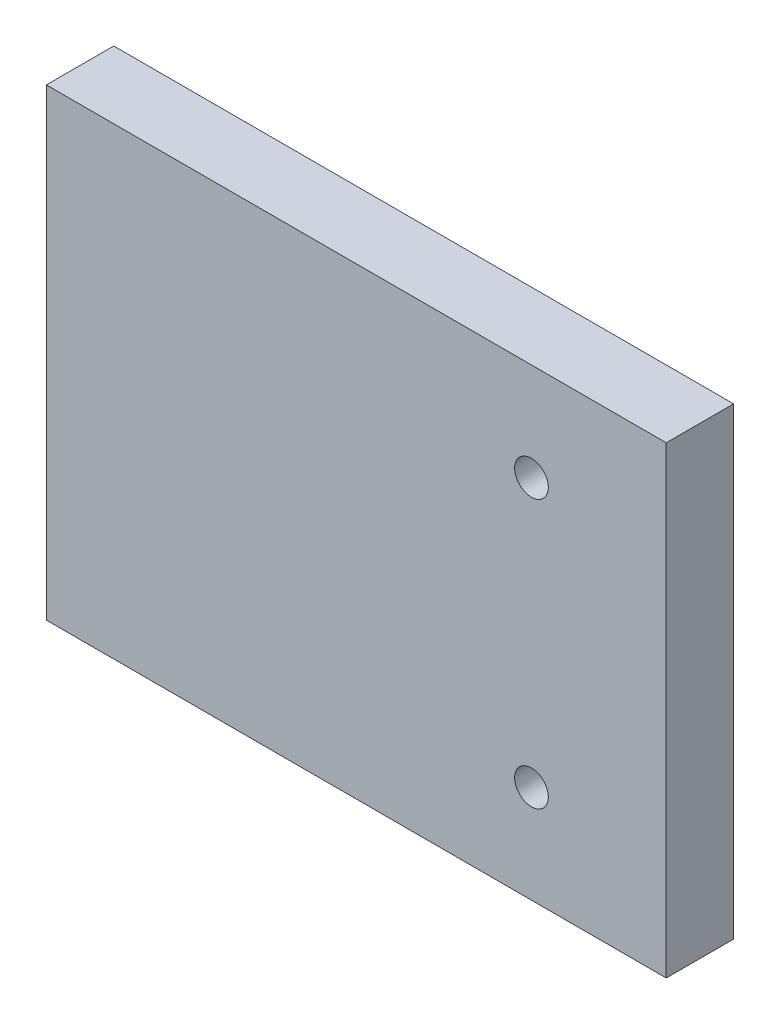
ISO-10303-21;
HEADER;
FILE_DESCRIPTION(('STEP AP214'),'2;1');
FILE_NAME('part.step','',(''),(''),'','','');
FILE_SCHEMA(('AUTOMOTIVE_DESIGN { 1 0 10303 214 1 1 1 1 }'));
ENDSEC;
DATA;
#1=APPLICATION_CONTEXT('core data for automotive mechanical design processes');
#2=APPLICATION_PROTOCOL_DEFINITION('international standard','automotive_design',2000,#1);
#3=PRODUCT_CONTEXT('',#1,'mechanical');
#4=PRODUCT('Part','Part','',(#3));
#5=PRODUCT_RELATED_PRODUCT_CATEGORY('part','',(#4));
#6=PRODUCT_DEFINITION_FORMATION('','',#4);
#7=PRODUCT_DEFINITION_CONTEXT('part definition',#1,'design');
#8=PRODUCT_DEFINITION('design','',#6,#7);
#9=PRODUCT_DEFINITION_SHAPE('','',#8);
#10=(LENGTH_UNIT() NAMED_UNIT(*) SI_UNIT(.MILLI.,.METRE.));
#11=(NAMED_UNIT(*) PLANE_ANGLE_UNIT() SI_UNIT($,.RADIAN.));
#12=(NAMED_UNIT(*) SI_UNIT($,.STERADIAN.) SOLID_ANGLE_UNIT());
#13=UNCERTAINTY_MEASURE_WITH_UNIT(LENGTH_MEASURE(1.E-05),#10,'distance_accuracy_value','');
#14=(GEOMETRIC_REPRESENTATION_CONTEXT(3) GLOBAL_UNCERTAINTY_ASSIGNED_CONTEXT((#13)) GLOBAL_UNIT_ASSIGNED_CONTEXT((#10,
#11,#12)) REPRESENTATION_CONTEXT('',''));
#15=CARTESIAN_POINT('',(0.,0.,0.));
#16=DIRECTION('',(0.,0.,1.));
#17=DIRECTION('',(1.,0.,0.));
#18=AXIS2_PLACEMENT_3D('',#15,#16,#17);
#19=CARTESIAN_POINT('',(0.,0.,6.35));
#20=DIRECTION('',(0.,0.,-1.));
#21=DIRECTION('',(-1.,0.,0.));
#22=AXIS2_PLACEMENT_3D('',#19,#20,#21);
#23=PLANE('',#22);
#24=CARTESIAN_POINT('',(45.72,34.4805,6.35));
#25=DIRECTION('',(0.,0.,1.));
#26=DIRECTION('',(1.,0.,0.));
#27=AXIS2_PLACEMENT_3D('',#24,#25,#26);
#28=CIRCLE('',#27,1.5875);
#29=CARTESIAN_POINT('',(47.3075,34.4805,6.35));
#30=VERTEX_POINT('',#29);
#31=EDGE_CURVE('E102',#30,#30,#28,.T.);
#32=ORIENTED_EDGE('',*,*,#31,.F.);
#33=EDGE_LOOP('',(#32));
#34=FACE_BOUND('',#33,.T.);
#35=DIRECTION('',(0.,-1.,0.));
#36=VECTOR('',#35,1.);
#37=CARTESIAN_POINT('',(0.,0.,6.35));
#38=LINE('',#37,#36);
#39=CARTESIAN_POINT('',(0.,43.688,6.35));
#40=VERTEX_POINT('',#39);
#41=CARTESIAN_POINT('',(0.,0.,6.35));
#42=VERTEX_POINT('',#41);
#43=EDGE_CURVE('E87',#40,#42,#38,.T.);
#44=ORIENTED_EDGE('',*,*,#43,.T.);
#45=DIRECTION('',(1.,0.,0.));
#46=VECTOR('',#45,1.);
#47=CARTESIAN_POINT('',(0.,0.,6.35));
#48=LINE('',#47,#46);
#49=CARTESIAN_POINT('',(58.42,0.,6.35));
#50=VERTEX_POINT('',#49);
#51=EDGE_CURVE('E82',#42,#50,#48,.T.);
#52=ORIENTED_EDGE('',*,*,#51,.T.);
#53=DIRECTION('',(0.,1.,0.));
#54=VECTOR('',#53,1.);
#55=CARTESIAN_POINT('',(58.42,0.,6.35));
#56=LINE('',#55,#54);
#57=CARTESIAN_POINT('',(58.42,43.688,6.35));
#58=VERTEX_POINT('',#57);
#59=EDGE_CURVE('E85',#50,#58,#56,.T.);
#60=ORIENTED_EDGE('',*,*,#59,.T.);
#61=DIRECTION('',(-1.,0.,0.));
#62=VECTOR('',#61,1.);
#63=CARTESIAN_POINT('',(0.,43.688,6.35));
#64=LINE('',#63,#62);
#65=EDGE_CURVE('E52',#58,#40,#64,.T.);
#66=ORIENTED_EDGE('',*,*,#65,.T.);
#67=EDGE_LOOP('',(#44,#52,#60,#66));
#68=FACE_BOUND('',#67,.T.);
#69=CARTESIAN_POINT('',(45.72,9.20749999999999,6.35));
#70=DIRECTION('',(0.,0.,1.));
#71=DIRECTION('',(-1.,0.,0.));
#72=AXIS2_PLACEMENT_3D('',#69,#70,#71);
#73=CIRCLE('',#72,1.5875);
#74=CARTESIAN_POINT('',(44.1325,9.20749999999999,6.35));
#75=VERTEX_POINT('',#74);
#76=EDGE_CURVE('E117',#75,#75,#73,.T.);
#77=ORIENTED_EDGE('',*,*,#76,.F.);
#78=EDGE_LOOP('',(#77));
#79=FACE_BOUND('',#78,.T.);
#80=ADVANCED_FACE('F35',(#34,#68,#79),#23,.F.);
#81=CARTESIAN_POINT('',(0.,0.,0.));
#82=DIRECTION('',(0.,0.,-1.));
#83=DIRECTION('',(-1.,0.,0.));
#84=AXIS2_PLACEMENT_3D('',#81,#82,#83);
#85=PLANE('',#84);
#86=CARTESIAN_POINT('',(45.72,34.4805,0.));
#87=DIRECTION('',(0.,0.,1.));
#88=DIRECTION('',(1.,0.,0.));
#89=AXIS2_PLACEMENT_3D('',#86,#87,#88);
#90=CIRCLE('',#89,1.5875);
#91=CARTESIAN_POINT('',(47.3075,34.4805,0.));
#92=VERTEX_POINT('',#91);
#93=EDGE_CURVE('E114',#92,#92,#90,.T.);
#94=ORIENTED_EDGE('',*,*,#93,.T.);
#95=EDGE_LOOP('',(#94));
#96=FACE_BOUND('',#95,.T.);
#97=DIRECTION('',(0.,-1.,0.));
#98=VECTOR('',#97,1.);
#99=CARTESIAN_POINT('',(0.,0.,0.));
#100=LINE('',#99,#98);
#101=CARTESIAN_POINT('',(0.,43.688,0.));
#102=VERTEX_POINT('',#101);
#103=CARTESIAN_POINT('',(0.,0.,0.));
#104=VERTEX_POINT('',#103);
#105=EDGE_CURVE('E99',#102,#104,#100,.T.);
#106=ORIENTED_EDGE('',*,*,#105,.F.);
#107=DIRECTION('',(-1.,0.,0.));
#108=VECTOR('',#107,1.);
#109=CARTESIAN_POINT('',(0.,43.688,0.));
#110=LINE('',#109,#108);
#111=CARTESIAN_POINT('',(58.42,43.688,0.));
#112=VERTEX_POINT('',#111);
#113=EDGE_CURVE('E75',#112,#102,#110,.T.);
#114=ORIENTED_EDGE('',*,*,#113,.F.);
#115=DIRECTION('',(0.,1.,0.));
#116=VECTOR('',#115,1.);
#117=CARTESIAN_POINT('',(58.42,0.,0.));
#118=LINE('',#117,#116);
#119=CARTESIAN_POINT('',(58.42,0.,0.));
#120=VERTEX_POINT('',#119);
#121=EDGE_CURVE('E69',#120,#112,#118,.T.);
#122=ORIENTED_EDGE('',*,*,#121,.F.);
#123=DIRECTION('',(1.,0.,0.));
#124=VECTOR('',#123,1.);
#125=CARTESIAN_POINT('',(0.,0.,0.));
#126=LINE('',#125,#124);
#127=EDGE_CURVE('E91',#104,#120,#126,.T.);
#128=ORIENTED_EDGE('',*,*,#127,.F.);
#129=EDGE_LOOP('',(#106,#114,#122,#128));
#130=FACE_BOUND('',#129,.T.);
#131=CARTESIAN_POINT('',(45.72,9.20749999999999,0.));
#132=DIRECTION('',(0.,0.,1.));
#133=DIRECTION('',(-1.,0.,0.));
#134=AXIS2_PLACEMENT_3D('',#131,#132,#133);
#135=CIRCLE('',#134,1.5875);
#136=CARTESIAN_POINT('',(44.1325,9.20749999999999,0.));
#137=VERTEX_POINT('',#136);
#138=EDGE_CURVE('E120',#137,#137,#135,.T.);
#139=ORIENTED_EDGE('',*,*,#138,.T.);
#140=EDGE_LOOP('',(#139));
#141=FACE_BOUND('',#140,.T.);
#142=ADVANCED_FACE('F110',(#96,#130,#141),#85,.T.);
#143=CARTESIAN_POINT('',(0.,0.,6.35));
#144=DIRECTION('',(1.,0.,0.));
#145=DIRECTION('',(0.,0.,-1.));
#146=AXIS2_PLACEMENT_3D('',#143,#144,#145);
#147=PLANE('',#146);
#148=ORIENTED_EDGE('',*,*,#105,.T.);
#149=DIRECTION('',(0.,0.,-1.));
#150=VECTOR('',#149,1.);
#151=CARTESIAN_POINT('',(0.,0.,6.35));
#152=LINE('',#151,#150);
#153=EDGE_CURVE('E11',#42,#104,#152,.T.);
#154=ORIENTED_EDGE('',*,*,#153,.F.);
#155=ORIENTED_EDGE('',*,*,#43,.F.);
#156=DIRECTION('',(0.,0.,-1.));
#157=VECTOR('',#156,1.);
#158=CARTESIAN_POINT('',(0.,43.688,6.35));
#159=LINE('',#158,#157);
#160=EDGE_CURVE('E95',#40,#102,#159,.T.);
#161=ORIENTED_EDGE('',*,*,#160,.T.);
#162=EDGE_LOOP('',(#148,#154,#155,#161));
#163=FACE_BOUND('',#162,.T.);
#164=ADVANCED_FACE('F37',(#163),#147,.F.);
#165=CARTESIAN_POINT('',(0.,0.,6.35));
#166=DIRECTION('',(0.,1.,0.));
#167=DIRECTION('',(0.,0.,1.));
#168=AXIS2_PLACEMENT_3D('',#165,#166,#167);
#169=PLANE('',#168);
#170=ORIENTED_EDGE('',*,*,#127,.T.);
#171=DIRECTION('',(0.,0.,-1.));
#172=VECTOR('',#171,1.);
#173=CARTESIAN_POINT('',(58.42,0.,6.35));
#174=LINE('',#173,#172);
#175=EDGE_CURVE('E44',#50,#120,#174,.T.);
#176=ORIENTED_EDGE('',*,*,#175,.F.);
#177=ORIENTED_EDGE('',*,*,#51,.F.);
#178=ORIENTED_EDGE('',*,*,#153,.T.);
#179=EDGE_LOOP('',(#170,#176,#177,#178));
#180=FACE_BOUND('',#179,.T.);
#181=ADVANCED_FACE('F90',(#180),#169,.F.);
#182=CARTESIAN_POINT('',(58.42,0.,6.35));
#183=DIRECTION('',(-1.,0.,0.));
#184=DIRECTION('',(0.,0.,1.));
#185=AXIS2_PLACEMENT_3D('',#182,#183,#184);
#186=PLANE('',#185);
#187=ORIENTED_EDGE('',*,*,#121,.T.);
#188=DIRECTION('',(0.,0.,-1.));
#189=VECTOR('',#188,1.);
#190=CARTESIAN_POINT('',(58.42,43.688,6.35));
#191=LINE('',#190,#189);
#192=EDGE_CURVE('E92',#58,#112,#191,.T.);
#193=ORIENTED_EDGE('',*,*,#192,.F.);
#194=ORIENTED_EDGE('',*,*,#59,.F.);
#195=ORIENTED_EDGE('',*,*,#175,.T.);
#196=EDGE_LOOP('',(#187,#193,#194,#195));
#197=FACE_BOUND('',#196,.T.);
#198=ADVANCED_FACE('F93',(#197),#186,.F.);
#199=CARTESIAN_POINT('',(0.,43.688,6.35));
#200=DIRECTION('',(0.,-1.,0.));
#201=DIRECTION('',(0.,0.,-1.));
#202=AXIS2_PLACEMENT_3D('',#199,#200,#201);
#203=PLANE('',#202);
#204=ORIENTED_EDGE('',*,*,#113,.T.);
#205=ORIENTED_EDGE('',*,*,#160,.F.);
#206=ORIENTED_EDGE('',*,*,#65,.F.);
#207=ORIENTED_EDGE('',*,*,#192,.T.);
#208=EDGE_LOOP('',(#204,#205,#206,#207));
#209=FACE_BOUND('',#208,.T.);
#210=ADVANCED_FACE('F107',(#209),#203,.F.);
#211=CARTESIAN_POINT('',(45.72,34.4805,6.35));
#212=DIRECTION('',(0.,0.,-1.));
#213=DIRECTION('',(-1.,0.,0.));
#214=AXIS2_PLACEMENT_3D('',#211,#212,#213);
#215=CYLINDRICAL_SURFACE('',#214,1.5875);
#216=ORIENTED_EDGE('',*,*,#31,.T.);
#217=EDGE_LOOP('',(#216));
#218=FACE_BOUND('',#217,.T.);
#219=ORIENTED_EDGE('',*,*,#93,.F.);
#220=EDGE_LOOP('',(#219));
#221=FACE_BOUND('',#220,.T.);
#222=ADVANCED_FACE('F138',(#218,#221),#215,.F.);
#223=CARTESIAN_POINT('',(45.72,9.20749999999999,6.35));
#224=DIRECTION('',(0.,0.,-1.));
#225=DIRECTION('',(-1.,0.,0.));
#226=AXIS2_PLACEMENT_3D('',#223,#224,#225);
#227=CYLINDRICAL_SURFACE('',#226,1.5875);
#228=ORIENTED_EDGE('',*,*,#76,.T.);
#229=EDGE_LOOP('',(#228));
#230=FACE_BOUND('',#229,.T.);
#231=ORIENTED_EDGE('',*,*,#138,.F.);
#232=EDGE_LOOP('',(#231));
#233=FACE_BOUND('',#232,.T.);
#234=ADVANCED_FACE('F126',(#230,#233),#227,.F.);
#235=CLOSED_SHELL('',(#80,#142,#164,#181,#198,#210,#222,#234));
#236=MANIFOLD_SOLID_BREP('B2',#235);
#237=ADVANCED_BREP_SHAPE_REPRESENTATION('',(#18,#236),#14);
#238=SHAPE_DEFINITION_REPRESENTATION(#9,#237);
ENDSEC;
END-ISO-10303-21;
